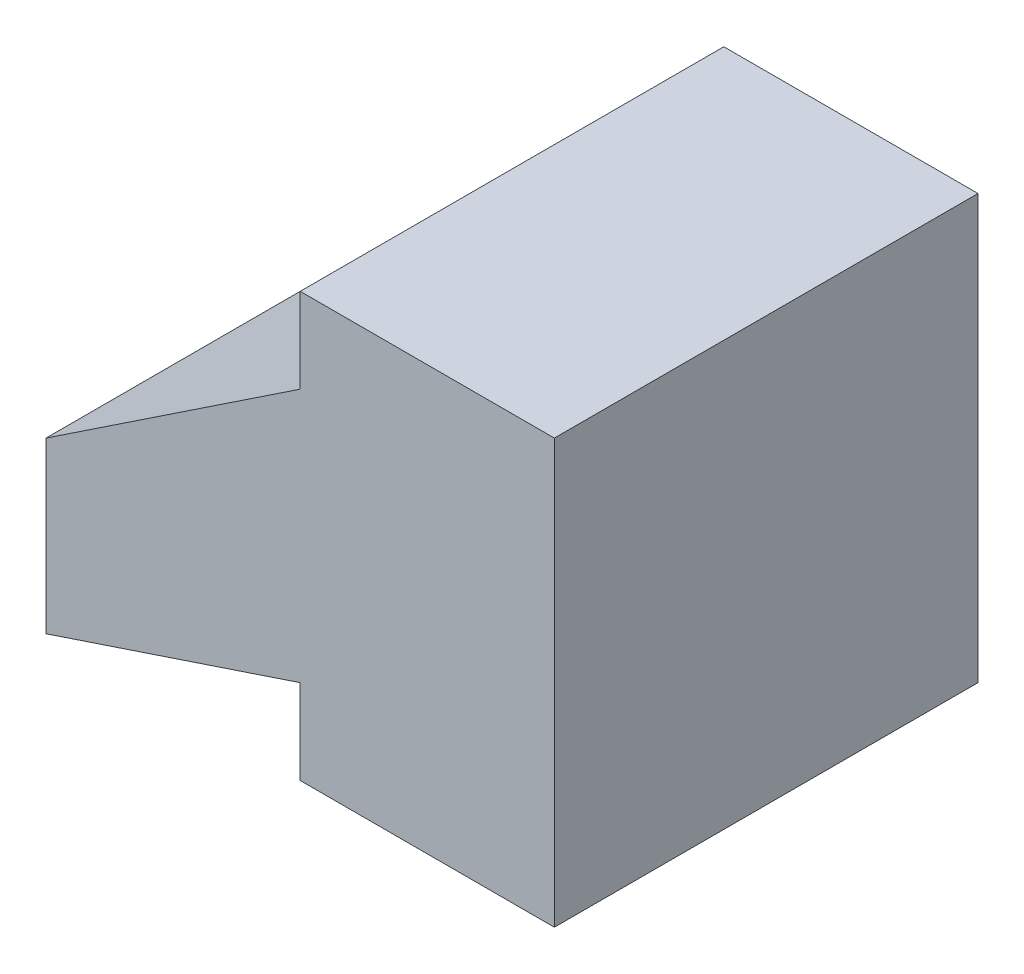
ISO-10303-21;
HEADER;
FILE_DESCRIPTION(('STEP AP214'),'2;1');
FILE_NAME('part.step','',(''),(''),'','','');
FILE_SCHEMA(('AUTOMOTIVE_DESIGN { 1 0 10303 214 1 1 1 1 }'));
ENDSEC;
DATA;
#1=APPLICATION_CONTEXT('core data for automotive mechanical design processes');
#2=APPLICATION_PROTOCOL_DEFINITION('international standard','automotive_design',2000,#1);
#3=PRODUCT_CONTEXT('',#1,'mechanical');
#4=PRODUCT('Part','Part','',(#3));
#5=PRODUCT_RELATED_PRODUCT_CATEGORY('part','',(#4));
#6=PRODUCT_DEFINITION_FORMATION('','',#4);
#7=PRODUCT_DEFINITION_CONTEXT('part definition',#1,'design');
#8=PRODUCT_DEFINITION('design','',#6,#7);
#9=PRODUCT_DEFINITION_SHAPE('','',#8);
#10=(LENGTH_UNIT() NAMED_UNIT(*) SI_UNIT(.MILLI.,.METRE.));
#11=(NAMED_UNIT(*) PLANE_ANGLE_UNIT() SI_UNIT($,.RADIAN.));
#12=(NAMED_UNIT(*) SI_UNIT($,.STERADIAN.) SOLID_ANGLE_UNIT());
#13=UNCERTAINTY_MEASURE_WITH_UNIT(LENGTH_MEASURE(1.E-05),#10,'distance_accuracy_value','');
#14=(GEOMETRIC_REPRESENTATION_CONTEXT(3) GLOBAL_UNCERTAINTY_ASSIGNED_CONTEXT((#13)) GLOBAL_UNIT_ASSIGNED_CONTEXT((#10,
#11,#12)) REPRESENTATION_CONTEXT('',''));
#15=CARTESIAN_POINT('',(0.,0.,0.));
#16=DIRECTION('',(0.,0.,1.));
#17=DIRECTION('',(1.,0.,0.));
#18=AXIS2_PLACEMENT_3D('',#15,#16,#17);
#19=CARTESIAN_POINT('',(3.,0.,5.));
#20=DIRECTION('',(0.,1.,0.));
#21=DIRECTION('',(-1.,0.,0.));
#22=AXIS2_PLACEMENT_3D('',#19,#20,#21);
#23=PLANE('',#22);
#24=DIRECTION('',(1.,0.,0.));
#25=VECTOR('',#24,1.);
#26=CARTESIAN_POINT('',(3.,0.,0.));
#27=LINE('',#26,#25);
#28=CARTESIAN_POINT('',(0.,0.,0.));
#29=VERTEX_POINT('',#28);
#30=CARTESIAN_POINT('',(3.,0.,0.));
#31=VERTEX_POINT('',#30);
#32=EDGE_CURVE('E129',#29,#31,#27,.T.);
#33=ORIENTED_EDGE('',*,*,#32,.T.);
#34=DIRECTION('',(0.,0.,-1.));
#35=VECTOR('',#34,1.);
#36=CARTESIAN_POINT('',(3.,0.,5.));
#37=LINE('',#36,#35);
#38=CARTESIAN_POINT('',(3.,0.,5.));
#39=VERTEX_POINT('',#38);
#40=EDGE_CURVE('E11',#39,#31,#37,.T.);
#41=ORIENTED_EDGE('',*,*,#40,.F.);
#42=DIRECTION('',(1.,0.,0.));
#43=VECTOR('',#42,1.);
#44=CARTESIAN_POINT('',(3.,0.,5.));
#45=LINE('',#44,#43);
#46=CARTESIAN_POINT('',(0.,0.,5.));
#47=VERTEX_POINT('',#46);
#48=EDGE_CURVE('E143',#47,#39,#45,.T.);
#49=ORIENTED_EDGE('',*,*,#48,.F.);
#50=DIRECTION('',(0.,0.,-1.));
#51=VECTOR('',#50,1.);
#52=CARTESIAN_POINT('',(0.,0.,5.));
#53=LINE('',#52,#51);
#54=EDGE_CURVE('E125',#47,#29,#53,.T.);
#55=ORIENTED_EDGE('',*,*,#54,.T.);
#56=EDGE_LOOP('',(#33,#41,#49,#55));
#57=FACE_BOUND('',#56,.T.);
#58=ADVANCED_FACE('F33',(#57),#23,.F.);
#59=CARTESIAN_POINT('',(3.,5.,5.));
#60=DIRECTION('',(-1.,0.,0.));
#61=DIRECTION('',(0.,-1.,0.));
#62=AXIS2_PLACEMENT_3D('',#59,#60,#61);
#63=PLANE('',#62);
#64=DIRECTION('',(0.,1.,0.));
#65=VECTOR('',#64,1.);
#66=CARTESIAN_POINT('',(3.,5.,0.));
#67=LINE('',#66,#65);
#68=CARTESIAN_POINT('',(3.,5.,0.));
#69=VERTEX_POINT('',#68);
#70=EDGE_CURVE('E132',#31,#69,#67,.T.);
#71=ORIENTED_EDGE('',*,*,#70,.T.);
#72=DIRECTION('',(0.,0.,-1.));
#73=VECTOR('',#72,1.);
#74=CARTESIAN_POINT('',(3.,5.,5.));
#75=LINE('',#74,#73);
#76=CARTESIAN_POINT('',(3.,5.,5.));
#77=VERTEX_POINT('',#76);
#78=EDGE_CURVE('E41',#77,#69,#75,.T.);
#79=ORIENTED_EDGE('',*,*,#78,.F.);
#80=DIRECTION('',(0.,1.,0.));
#81=VECTOR('',#80,1.);
#82=CARTESIAN_POINT('',(3.,5.,5.));
#83=LINE('',#82,#81);
#84=EDGE_CURVE('E92',#39,#77,#83,.T.);
#85=ORIENTED_EDGE('',*,*,#84,.F.);
#86=ORIENTED_EDGE('',*,*,#40,.T.);
#87=EDGE_LOOP('',(#71,#79,#85,#86));
#88=FACE_BOUND('',#87,.T.);
#89=ADVANCED_FACE('F178',(#88),#63,.F.);
#90=CARTESIAN_POINT('',(0.,5.,5.));
#91=DIRECTION('',(0.,-1.,0.));
#92=DIRECTION('',(0.,0.,-1.));
#93=AXIS2_PLACEMENT_3D('',#90,#91,#92);
#94=PLANE('',#93);
#95=DIRECTION('',(-1.,0.,0.));
#96=VECTOR('',#95,1.);
#97=CARTESIAN_POINT('',(0.,5.,0.));
#98=LINE('',#97,#96);
#99=CARTESIAN_POINT('',(0.,5.,0.));
#100=VERTEX_POINT('',#99);
#101=EDGE_CURVE('E134',#69,#100,#98,.T.);
#102=ORIENTED_EDGE('',*,*,#101,.T.);
#103=DIRECTION('',(0.,0.,-1.));
#104=VECTOR('',#103,1.);
#105=CARTESIAN_POINT('',(0.,5.,5.));
#106=LINE('',#105,#104);
#107=CARTESIAN_POINT('',(0.,5.,5.));
#108=VERTEX_POINT('',#107);
#109=EDGE_CURVE('E150',#108,#100,#106,.T.);
#110=ORIENTED_EDGE('',*,*,#109,.F.);
#111=DIRECTION('',(-1.,0.,0.));
#112=VECTOR('',#111,1.);
#113=CARTESIAN_POINT('',(0.,5.,5.));
#114=LINE('',#113,#112);
#115=EDGE_CURVE('E158',#77,#108,#114,.T.);
#116=ORIENTED_EDGE('',*,*,#115,.F.);
#117=ORIENTED_EDGE('',*,*,#78,.T.);
#118=EDGE_LOOP('',(#102,#110,#116,#117));
#119=FACE_BOUND('',#118,.T.);
#120=ADVANCED_FACE('F156',(#119),#94,.F.);
#121=CARTESIAN_POINT('',(0.,4.,5.));
#122=DIRECTION('',(1.,0.,0.));
#123=DIRECTION('',(0.,0.,-1.));
#124=AXIS2_PLACEMENT_3D('',#121,#122,#123);
#125=PLANE('',#124);
#126=DIRECTION('',(0.,-1.,0.));
#127=VECTOR('',#126,1.);
#128=CARTESIAN_POINT('',(0.,4.,0.));
#129=LINE('',#128,#127);
#130=CARTESIAN_POINT('',(0.,4.,0.));
#131=VERTEX_POINT('',#130);
#132=EDGE_CURVE('E136',#100,#131,#129,.T.);
#133=ORIENTED_EDGE('',*,*,#132,.T.);
#134=DIRECTION('',(0.,0.,-1.));
#135=VECTOR('',#134,1.);
#136=CARTESIAN_POINT('',(0.,4.,5.));
#137=LINE('',#136,#135);
#138=CARTESIAN_POINT('',(0.,4.,5.));
#139=VERTEX_POINT('',#138);
#140=EDGE_CURVE('E147',#139,#131,#137,.T.);
#141=ORIENTED_EDGE('',*,*,#140,.F.);
#142=DIRECTION('',(0.,-1.,0.));
#143=VECTOR('',#142,1.);
#144=CARTESIAN_POINT('',(0.,4.,5.));
#145=LINE('',#144,#143);
#146=EDGE_CURVE('E170',#108,#139,#145,.T.);
#147=ORIENTED_EDGE('',*,*,#146,.F.);
#148=ORIENTED_EDGE('',*,*,#109,.T.);
#149=EDGE_LOOP('',(#133,#141,#147,#148));
#150=FACE_BOUND('',#149,.T.);
#151=ADVANCED_FACE('F166',(#150),#125,.F.);
#152=CARTESIAN_POINT('',(-3.,2.,5.));
#153=DIRECTION('',(0.554700196225229,-0.832050294337844,0.));
#154=DIRECTION('',(0.832050294337844,0.554700196225229,0.));
#155=AXIS2_PLACEMENT_3D('',#152,#153,#154);
#156=PLANE('',#155);
#157=DIRECTION('',(-0.832050294337844,-0.554700196225229,0.));
#158=VECTOR('',#157,1.);
#159=CARTESIAN_POINT('',(-3.,2.,0.));
#160=LINE('',#159,#158);
#161=CARTESIAN_POINT('',(-3.,2.,0.));
#162=VERTEX_POINT('',#161);
#163=EDGE_CURVE('E138',#131,#162,#160,.T.);
#164=ORIENTED_EDGE('',*,*,#163,.T.);
#165=DIRECTION('',(0.,0.,-1.));
#166=VECTOR('',#165,1.);
#167=CARTESIAN_POINT('',(-3.,2.,5.));
#168=LINE('',#167,#166);
#169=CARTESIAN_POINT('',(-3.,2.,5.));
#170=VERTEX_POINT('',#169);
#171=EDGE_CURVE('E120',#170,#162,#168,.T.);
#172=ORIENTED_EDGE('',*,*,#171,.F.);
#173=DIRECTION('',(-0.832050294337844,-0.554700196225229,0.));
#174=VECTOR('',#173,1.);
#175=CARTESIAN_POINT('',(-3.,2.,5.));
#176=LINE('',#175,#174);
#177=EDGE_CURVE('E111',#139,#170,#176,.T.);
#178=ORIENTED_EDGE('',*,*,#177,.F.);
#179=ORIENTED_EDGE('',*,*,#140,.T.);
#180=EDGE_LOOP('',(#164,#172,#178,#179));
#181=FACE_BOUND('',#180,.T.);
#182=ADVANCED_FACE('F169',(#181),#156,.F.);
#183=CARTESIAN_POINT('',(-3.,0.,5.));
#184=DIRECTION('',(1.,0.,0.));
#185=DIRECTION('',(0.,0.,-1.));
#186=AXIS2_PLACEMENT_3D('',#183,#184,#185);
#187=PLANE('',#186);
#188=DIRECTION('',(0.,-1.,0.));
#189=VECTOR('',#188,1.);
#190=CARTESIAN_POINT('',(-3.,0.,0.));
#191=LINE('',#190,#189);
#192=CARTESIAN_POINT('',(-3.,0.,0.));
#193=VERTEX_POINT('',#192);
#194=EDGE_CURVE('E119',#162,#193,#191,.T.);
#195=ORIENTED_EDGE('',*,*,#194,.T.);
#196=DIRECTION('',(0.,0.,-1.));
#197=VECTOR('',#196,1.);
#198=CARTESIAN_POINT('',(-3.,0.,5.));
#199=LINE('',#198,#197);
#200=CARTESIAN_POINT('',(-3.,0.,5.));
#201=VERTEX_POINT('',#200);
#202=EDGE_CURVE('E116',#201,#193,#199,.T.);
#203=ORIENTED_EDGE('',*,*,#202,.F.);
#204=DIRECTION('',(0.,-1.,0.));
#205=VECTOR('',#204,1.);
#206=CARTESIAN_POINT('',(-3.,0.,5.));
#207=LINE('',#206,#205);
#208=EDGE_CURVE('E105',#170,#201,#207,.T.);
#209=ORIENTED_EDGE('',*,*,#208,.F.);
#210=ORIENTED_EDGE('',*,*,#171,.T.);
#211=EDGE_LOOP('',(#195,#203,#209,#210));
#212=FACE_BOUND('',#211,.T.);
#213=ADVANCED_FACE('F117',(#212),#187,.F.);
#214=CARTESIAN_POINT('',(0.,1.,5.));
#215=DIRECTION('',(-0.316227766016838,0.948683298050514,0.));
#216=DIRECTION('',(-0.948683298050514,-0.316227766016838,0.));
#217=AXIS2_PLACEMENT_3D('',#214,#215,#216);
#218=PLANE('',#217);
#219=DIRECTION('',(0.948683298050514,0.316227766016838,0.));
#220=VECTOR('',#219,1.);
#221=CARTESIAN_POINT('',(0.,1.,0.));
#222=LINE('',#221,#220);
#223=CARTESIAN_POINT('',(0.,1.,0.));
#224=VERTEX_POINT('',#223);
#225=EDGE_CURVE('E78',#193,#224,#222,.T.);
#226=ORIENTED_EDGE('',*,*,#225,.T.);
#227=DIRECTION('',(0.,0.,-1.));
#228=VECTOR('',#227,1.);
#229=CARTESIAN_POINT('',(0.,1.,5.));
#230=LINE('',#229,#228);
#231=CARTESIAN_POINT('',(0.,1.,5.));
#232=VERTEX_POINT('',#231);
#233=EDGE_CURVE('E121',#232,#224,#230,.T.);
#234=ORIENTED_EDGE('',*,*,#233,.F.);
#235=DIRECTION('',(0.948683298050514,0.316227766016838,0.));
#236=VECTOR('',#235,1.);
#237=CARTESIAN_POINT('',(0.,1.,5.));
#238=LINE('',#237,#236);
#239=EDGE_CURVE('E109',#201,#232,#238,.T.);
#240=ORIENTED_EDGE('',*,*,#239,.F.);
#241=ORIENTED_EDGE('',*,*,#202,.T.);
#242=EDGE_LOOP('',(#226,#234,#240,#241));
#243=FACE_BOUND('',#242,.T.);
#244=ADVANCED_FACE('F123',(#243),#218,.F.);
#245=CARTESIAN_POINT('',(0.,0.,5.));
#246=DIRECTION('',(1.,0.,0.));
#247=DIRECTION('',(0.,0.,-1.));
#248=AXIS2_PLACEMENT_3D('',#245,#246,#247);
#249=PLANE('',#248);
#250=DIRECTION('',(0.,-1.,0.));
#251=VECTOR('',#250,1.);
#252=CARTESIAN_POINT('',(0.,0.,0.));
#253=LINE('',#252,#251);
#254=EDGE_CURVE('E84',#224,#29,#253,.T.);
#255=ORIENTED_EDGE('',*,*,#254,.T.);
#256=ORIENTED_EDGE('',*,*,#54,.F.);
#257=DIRECTION('',(0.,-1.,0.));
#258=VECTOR('',#257,1.);
#259=CARTESIAN_POINT('',(0.,0.,5.));
#260=LINE('',#259,#258);
#261=EDGE_CURVE('E49',#232,#47,#260,.T.);
#262=ORIENTED_EDGE('',*,*,#261,.F.);
#263=ORIENTED_EDGE('',*,*,#233,.T.);
#264=EDGE_LOOP('',(#255,#256,#262,#263));
#265=FACE_BOUND('',#264,.T.);
#266=ADVANCED_FACE('F194',(#265),#249,.F.);
#267=CARTESIAN_POINT('',(0.,0.,5.));
#268=DIRECTION('',(0.,0.,-1.));
#269=DIRECTION('',(-1.,0.,0.));
#270=AXIS2_PLACEMENT_3D('',#267,#268,#269);
#271=PLANE('',#270);
#272=ORIENTED_EDGE('',*,*,#48,.T.);
#273=ORIENTED_EDGE('',*,*,#84,.T.);
#274=ORIENTED_EDGE('',*,*,#115,.T.);
#275=ORIENTED_EDGE('',*,*,#146,.T.);
#276=ORIENTED_EDGE('',*,*,#177,.T.);
#277=ORIENTED_EDGE('',*,*,#208,.T.);
#278=ORIENTED_EDGE('',*,*,#239,.T.);
#279=ORIENTED_EDGE('',*,*,#261,.T.);
#280=EDGE_LOOP('',(#272,#273,#274,#275,#276,#277,#278,#279));
#281=FACE_BOUND('',#280,.T.);
#282=ADVANCED_FACE('F107',(#281),#271,.F.);
#283=CARTESIAN_POINT('',(0.,0.,0.));
#284=DIRECTION('',(0.,0.,-1.));
#285=DIRECTION('',(-1.,0.,0.));
#286=AXIS2_PLACEMENT_3D('',#283,#284,#285);
#287=PLANE('',#286);
#288=ORIENTED_EDGE('',*,*,#32,.F.);
#289=ORIENTED_EDGE('',*,*,#254,.F.);
#290=ORIENTED_EDGE('',*,*,#225,.F.);
#291=ORIENTED_EDGE('',*,*,#194,.F.);
#292=ORIENTED_EDGE('',*,*,#163,.F.);
#293=ORIENTED_EDGE('',*,*,#132,.F.);
#294=ORIENTED_EDGE('',*,*,#101,.F.);
#295=ORIENTED_EDGE('',*,*,#70,.F.);
#296=EDGE_LOOP('',(#288,#289,#290,#291,#292,#293,#294,#295));
#297=FACE_BOUND('',#296,.T.);
#298=ADVANCED_FACE('F162',(#297),#287,.T.);
#299=CLOSED_SHELL('',(#58,#89,#120,#151,#182,#213,#244,#266,#282,#298));
#300=MANIFOLD_SOLID_BREP('B2',#299);
#301=ADVANCED_BREP_SHAPE_REPRESENTATION('',(#18,#300),#14);
#302=SHAPE_DEFINITION_REPRESENTATION(#9,#301);
ENDSEC;
END-ISO-10303-21;
